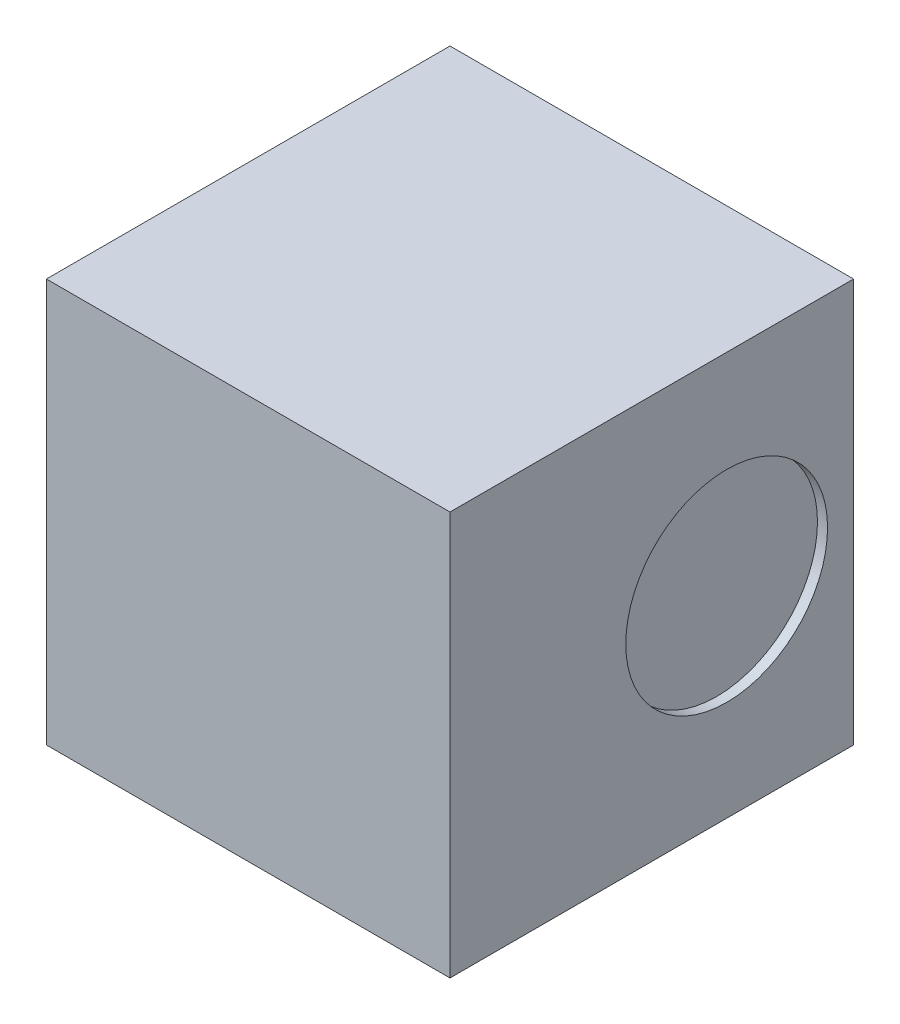
ISO-10303-21;
HEADER;
FILE_DESCRIPTION(('STEP AP214'),'2;1');
FILE_NAME('part.step','',(''),(''),'','','');
FILE_SCHEMA(('AUTOMOTIVE_DESIGN { 1 0 10303 214 1 1 1 1 }'));
ENDSEC;
DATA;
#1=APPLICATION_CONTEXT('core data for automotive mechanical design processes');
#2=APPLICATION_PROTOCOL_DEFINITION('international standard','automotive_design',2000,#1);
#3=PRODUCT_CONTEXT('',#1,'mechanical');
#4=PRODUCT('Part','Part','',(#3));
#5=PRODUCT_RELATED_PRODUCT_CATEGORY('part','',(#4));
#6=PRODUCT_DEFINITION_FORMATION('','',#4);
#7=PRODUCT_DEFINITION_CONTEXT('part definition',#1,'design');
#8=PRODUCT_DEFINITION('design','',#6,#7);
#9=PRODUCT_DEFINITION_SHAPE('','',#8);
#10=(LENGTH_UNIT() NAMED_UNIT(*) SI_UNIT(.MILLI.,.METRE.));
#11=(NAMED_UNIT(*) PLANE_ANGLE_UNIT() SI_UNIT($,.RADIAN.));
#12=(NAMED_UNIT(*) SI_UNIT($,.STERADIAN.) SOLID_ANGLE_UNIT());
#13=UNCERTAINTY_MEASURE_WITH_UNIT(LENGTH_MEASURE(1.E-05),#10,'distance_accuracy_value','');
#14=(GEOMETRIC_REPRESENTATION_CONTEXT(3) GLOBAL_UNCERTAINTY_ASSIGNED_CONTEXT((#13)) GLOBAL_UNIT_ASSIGNED_CONTEXT((#10,
#11,#12)) REPRESENTATION_CONTEXT('',''));
#15=CARTESIAN_POINT('',(0.,0.,0.));
#16=DIRECTION('',(0.,0.,1.));
#17=DIRECTION('',(1.,0.,0.));
#18=AXIS2_PLACEMENT_3D('',#15,#16,#17);
#19=CARTESIAN_POINT('',(-1.,2.,-1.));
#20=DIRECTION('',(1.,0.,0.));
#21=DIRECTION('',(0.,0.,-1.));
#22=AXIS2_PLACEMENT_3D('',#19,#20,#21);
#23=PLANE('',#22);
#24=DIRECTION('',(0.,0.,1.));
#25=VECTOR('',#24,1.);
#26=CARTESIAN_POINT('',(-1.,0.,-1.));
#27=LINE('',#26,#25);
#28=CARTESIAN_POINT('',(-1.,0.,-1.));
#29=VERTEX_POINT('',#28);
#30=CARTESIAN_POINT('',(-1.,0.,1.));
#31=VERTEX_POINT('',#30);
#32=EDGE_CURVE('E97',#29,#31,#27,.T.);
#33=ORIENTED_EDGE('',*,*,#32,.T.);
#34=DIRECTION('',(0.,-1.,0.));
#35=VECTOR('',#34,1.);
#36=CARTESIAN_POINT('',(-1.,2.,1.));
#37=LINE('',#36,#35);
#38=CARTESIAN_POINT('',(-1.,2.,1.));
#39=VERTEX_POINT('',#38);
#40=EDGE_CURVE('E11',#39,#31,#37,.T.);
#41=ORIENTED_EDGE('',*,*,#40,.F.);
#42=DIRECTION('',(0.,0.,1.));
#43=VECTOR('',#42,1.);
#44=CARTESIAN_POINT('',(-1.,2.,-1.));
#45=LINE('',#44,#43);
#46=CARTESIAN_POINT('',(-1.,2.,-1.));
#47=VERTEX_POINT('',#46);
#48=EDGE_CURVE('E85',#47,#39,#45,.T.);
#49=ORIENTED_EDGE('',*,*,#48,.F.);
#50=DIRECTION('',(0.,-1.,0.));
#51=VECTOR('',#50,1.);
#52=CARTESIAN_POINT('',(-1.,2.,-1.));
#53=LINE('',#52,#51);
#54=EDGE_CURVE('E93',#47,#29,#53,.T.);
#55=ORIENTED_EDGE('',*,*,#54,.T.);
#56=EDGE_LOOP('',(#33,#41,#49,#55));
#57=FACE_BOUND('',#56,.T.);
#58=ADVANCED_FACE('F34',(#57),#23,.F.);
#59=CARTESIAN_POINT('',(-1.,2.,1.));
#60=DIRECTION('',(0.,0.,-1.));
#61=DIRECTION('',(-1.,0.,0.));
#62=AXIS2_PLACEMENT_3D('',#59,#60,#61);
#63=PLANE('',#62);
#64=DIRECTION('',(1.,0.,0.));
#65=VECTOR('',#64,1.);
#66=CARTESIAN_POINT('',(-1.,0.,1.));
#67=LINE('',#66,#65);
#68=CARTESIAN_POINT('',(1.,0.,1.));
#69=VERTEX_POINT('',#68);
#70=EDGE_CURVE('E89',#31,#69,#67,.T.);
#71=ORIENTED_EDGE('',*,*,#70,.T.);
#72=DIRECTION('',(0.,-1.,0.));
#73=VECTOR('',#72,1.);
#74=CARTESIAN_POINT('',(1.,2.,1.));
#75=LINE('',#74,#73);
#76=CARTESIAN_POINT('',(1.,2.,1.));
#77=VERTEX_POINT('',#76);
#78=EDGE_CURVE('E42',#77,#69,#75,.T.);
#79=ORIENTED_EDGE('',*,*,#78,.F.);
#80=DIRECTION('',(1.,0.,0.));
#81=VECTOR('',#80,1.);
#82=CARTESIAN_POINT('',(-1.,2.,1.));
#83=LINE('',#82,#81);
#84=EDGE_CURVE('E80',#39,#77,#83,.T.);
#85=ORIENTED_EDGE('',*,*,#84,.F.);
#86=ORIENTED_EDGE('',*,*,#40,.T.);
#87=EDGE_LOOP('',(#71,#79,#85,#86));
#88=FACE_BOUND('',#87,.T.);
#89=ADVANCED_FACE('F88',(#88),#63,.F.);
#90=CARTESIAN_POINT('',(1.,2.,-1.));
#91=DIRECTION('',(-1.,0.,0.));
#92=DIRECTION('',(0.,0.,1.));
#93=AXIS2_PLACEMENT_3D('',#90,#91,#92);
#94=PLANE('',#93);
#95=CARTESIAN_POINT('',(1.,0.997145201259133,-0.37112383631371));
#96=DIRECTION('',(1.,0.,0.));
#97=DIRECTION('',(0.,0.,-1.));
#98=AXIS2_PLACEMENT_3D('',#95,#96,#97);
#99=CIRCLE('',#98,0.5);
#100=CARTESIAN_POINT('',(1.,0.997145201259133,-0.87112383631371));
#101=VERTEX_POINT('',#100);
#102=EDGE_CURVE('E111',#101,#101,#99,.T.);
#103=ORIENTED_EDGE('',*,*,#102,.F.);
#104=EDGE_LOOP('',(#103));
#105=FACE_BOUND('',#104,.T.);
#106=DIRECTION('',(0.,0.,-1.));
#107=VECTOR('',#106,1.);
#108=CARTESIAN_POINT('',(1.,0.,-1.));
#109=LINE('',#108,#107);
#110=CARTESIAN_POINT('',(1.,0.,-1.));
#111=VERTEX_POINT('',#110);
#112=EDGE_CURVE('E67',#69,#111,#109,.T.);
#113=ORIENTED_EDGE('',*,*,#112,.T.);
#114=DIRECTION('',(0.,-1.,0.));
#115=VECTOR('',#114,1.);
#116=CARTESIAN_POINT('',(1.,2.,-1.));
#117=LINE('',#116,#115);
#118=CARTESIAN_POINT('',(1.,2.,-1.));
#119=VERTEX_POINT('',#118);
#120=EDGE_CURVE('E90',#119,#111,#117,.T.);
#121=ORIENTED_EDGE('',*,*,#120,.F.);
#122=DIRECTION('',(0.,0.,-1.));
#123=VECTOR('',#122,1.);
#124=CARTESIAN_POINT('',(1.,2.,-1.));
#125=LINE('',#124,#123);
#126=EDGE_CURVE('E83',#77,#119,#125,.T.);
#127=ORIENTED_EDGE('',*,*,#126,.F.);
#128=ORIENTED_EDGE('',*,*,#78,.T.);
#129=EDGE_LOOP('',(#113,#121,#127,#128));
#130=FACE_BOUND('',#129,.T.);
#131=ADVANCED_FACE('F91',(#105,#130),#94,.F.);
#132=CARTESIAN_POINT('',(-1.,2.,-1.));
#133=DIRECTION('',(0.,0.,1.));
#134=DIRECTION('',(1.,0.,0.));
#135=AXIS2_PLACEMENT_3D('',#132,#133,#134);
#136=PLANE('',#135);
#137=DIRECTION('',(-1.,0.,0.));
#138=VECTOR('',#137,1.);
#139=CARTESIAN_POINT('',(-1.,0.,-1.));
#140=LINE('',#139,#138);
#141=EDGE_CURVE('E73',#111,#29,#140,.T.);
#142=ORIENTED_EDGE('',*,*,#141,.T.);
#143=ORIENTED_EDGE('',*,*,#54,.F.);
#144=DIRECTION('',(-1.,0.,0.));
#145=VECTOR('',#144,1.);
#146=CARTESIAN_POINT('',(-1.,2.,-1.));
#147=LINE('',#146,#145);
#148=EDGE_CURVE('E50',#119,#47,#147,.T.);
#149=ORIENTED_EDGE('',*,*,#148,.F.);
#150=ORIENTED_EDGE('',*,*,#120,.T.);
#151=EDGE_LOOP('',(#142,#143,#149,#150));
#152=FACE_BOUND('',#151,.T.);
#153=ADVANCED_FACE('F105',(#152),#136,.F.);
#154=CARTESIAN_POINT('',(0.,2.,0.));
#155=DIRECTION('',(0.,1.,0.));
#156=DIRECTION('',(0.,0.,1.));
#157=AXIS2_PLACEMENT_3D('',#154,#155,#156);
#158=PLANE('',#157);
#159=ORIENTED_EDGE('',*,*,#48,.T.);
#160=ORIENTED_EDGE('',*,*,#84,.T.);
#161=ORIENTED_EDGE('',*,*,#126,.T.);
#162=ORIENTED_EDGE('',*,*,#148,.T.);
#163=EDGE_LOOP('',(#159,#160,#161,#162));
#164=FACE_BOUND('',#163,.T.);
#165=ADVANCED_FACE('F81',(#164),#158,.T.);
#166=CARTESIAN_POINT('',(0.,0.,0.));
#167=DIRECTION('',(0.,1.,0.));
#168=DIRECTION('',(0.,0.,1.));
#169=AXIS2_PLACEMENT_3D('',#166,#167,#168);
#170=PLANE('',#169);
#171=ORIENTED_EDGE('',*,*,#32,.F.);
#172=ORIENTED_EDGE('',*,*,#141,.F.);
#173=ORIENTED_EDGE('',*,*,#112,.F.);
#174=ORIENTED_EDGE('',*,*,#70,.F.);
#175=EDGE_LOOP('',(#171,#172,#173,#174));
#176=FACE_BOUND('',#175,.T.);
#177=ADVANCED_FACE('F108',(#176),#170,.F.);
#178=CARTESIAN_POINT('',(0.95,0.997145201259133,-0.37112383631371));
#179=DIRECTION('',(1.,0.,0.));
#180=DIRECTION('',(0.,0.,-1.));
#181=AXIS2_PLACEMENT_3D('',#178,#179,#180);
#182=CYLINDRICAL_SURFACE('',#181,0.5);
#183=CARTESIAN_POINT('',(0.95,0.997145201259133,-0.37112383631371));
#184=DIRECTION('',(1.,0.,0.));
#185=DIRECTION('',(0.,0.,-1.));
#186=AXIS2_PLACEMENT_3D('',#183,#184,#185);
#187=CIRCLE('',#186,0.5);
#188=CARTESIAN_POINT('',(0.95,0.997145201259133,-0.87112383631371));
#189=VERTEX_POINT('',#188);
#190=EDGE_CURVE('E100',#189,#189,#187,.T.);
#191=ORIENTED_EDGE('',*,*,#190,.F.);
#192=EDGE_LOOP('',(#191));
#193=FACE_BOUND('',#192,.T.);
#194=ORIENTED_EDGE('',*,*,#102,.T.);
#195=EDGE_LOOP('',(#194));
#196=FACE_BOUND('',#195,.T.);
#197=ADVANCED_FACE('F119',(#193,#196),#182,.F.);
#198=CARTESIAN_POINT('',(0.95,0.997145201259133,-0.37112383631371));
#199=DIRECTION('',(1.,0.,0.));
#200=DIRECTION('',(0.,0.,-1.));
#201=AXIS2_PLACEMENT_3D('',#198,#199,#200);
#202=PLANE('',#201);
#203=ORIENTED_EDGE('',*,*,#190,.T.);
#204=EDGE_LOOP('',(#203));
#205=FACE_BOUND('',#204,.T.);
#206=ADVANCED_FACE('F117',(#205),#202,.T.);
#207=CLOSED_SHELL('',(#58,#89,#131,#153,#165,#177,#197,#206));
#208=MANIFOLD_SOLID_BREP('B2',#207);
#209=ADVANCED_BREP_SHAPE_REPRESENTATION('',(#18,#208),#14);
#210=SHAPE_DEFINITION_REPRESENTATION(#9,#209);
ENDSEC;
END-ISO-10303-21;
